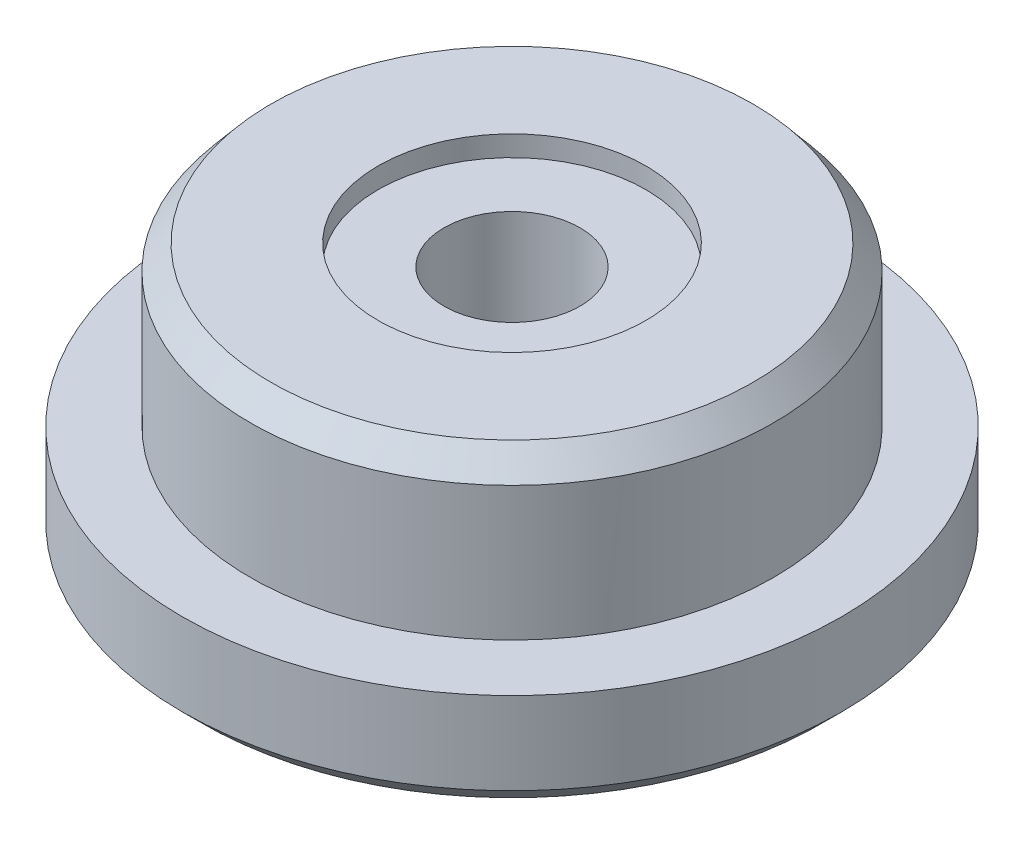
ISO-10303-21;
HEADER;
FILE_DESCRIPTION(('STEP AP214'),'2;1');
FILE_NAME('part.step','',(''),(''),'','','');
FILE_SCHEMA(('AUTOMOTIVE_DESIGN { 1 0 10303 214 1 1 1 1 }'));
ENDSEC;
DATA;
#1=APPLICATION_CONTEXT('core data for automotive mechanical design processes');
#2=APPLICATION_PROTOCOL_DEFINITION('international standard','automotive_design',2000,#1);
#3=PRODUCT_CONTEXT('',#1,'mechanical');
#4=PRODUCT('Part','Part','',(#3));
#5=PRODUCT_RELATED_PRODUCT_CATEGORY('part','',(#4));
#6=PRODUCT_DEFINITION_FORMATION('','',#4);
#7=PRODUCT_DEFINITION_CONTEXT('part definition',#1,'design');
#8=PRODUCT_DEFINITION('design','',#6,#7);
#9=PRODUCT_DEFINITION_SHAPE('','',#8);
#10=(LENGTH_UNIT() NAMED_UNIT(*) SI_UNIT(.MILLI.,.METRE.));
#11=(NAMED_UNIT(*) PLANE_ANGLE_UNIT() SI_UNIT($,.RADIAN.));
#12=(NAMED_UNIT(*) SI_UNIT($,.STERADIAN.) SOLID_ANGLE_UNIT());
#13=UNCERTAINTY_MEASURE_WITH_UNIT(LENGTH_MEASURE(1.E-05),#10,'distance_accuracy_value','');
#14=(GEOMETRIC_REPRESENTATION_CONTEXT(3) GLOBAL_UNCERTAINTY_ASSIGNED_CONTEXT((#13)) GLOBAL_UNIT_ASSIGNED_CONTEXT((#10,
#11,#12)) REPRESENTATION_CONTEXT('',''));
#15=CARTESIAN_POINT('',(0.,0.,0.));
#16=DIRECTION('',(0.,0.,1.));
#17=DIRECTION('',(1.,0.,0.));
#18=AXIS2_PLACEMENT_3D('',#15,#16,#17);
#19=CARTESIAN_POINT('',(-14.1950046636745,-3.57515728043431,0.));
#20=DIRECTION('',(0.,1.,0.));
#21=DIRECTION('',(-1.,0.,0.));
#22=AXIS2_PLACEMENT_3D('',#19,#20,#21);
#23=CYLINDRICAL_SURFACE('',#22,5.25);
#24=CARTESIAN_POINT('',(-14.1950046636745,-2.57515728043417,0.));
#25=DIRECTION('',(0.,1.,0.));
#26=DIRECTION('',(-1.,0.,0.));
#27=AXIS2_PLACEMENT_3D('',#24,#25,#26);
#28=CIRCLE('',#27,5.25);
#29=CARTESIAN_POINT('',(-19.4450046636745,-2.57515728043417,0.));
#30=VERTEX_POINT('',#29);
#31=EDGE_CURVE('E17',#30,#30,#28,.T.);
#32=ORIENTED_EDGE('',*,*,#31,.F.);
#33=EDGE_LOOP('',(#32));
#34=FACE_BOUND('',#33,.T.);
#35=CARTESIAN_POINT('',(-14.1950046636745,3.42484271956579,0.));
#36=DIRECTION('',(0.,1.,0.));
#37=DIRECTION('',(-1.,0.,0.));
#38=AXIS2_PLACEMENT_3D('',#35,#36,#37);
#39=CIRCLE('',#38,5.25);
#40=CARTESIAN_POINT('',(-19.4450046636745,3.42484271956579,0.));
#41=VERTEX_POINT('',#40);
#42=EDGE_CURVE('E61',#41,#41,#39,.F.);
#43=ORIENTED_EDGE('',*,*,#42,.F.);
#44=EDGE_LOOP('',(#43));
#45=FACE_BOUND('',#44,.T.);
#46=ADVANCED_FACE('F14',(#34,#45),#23,.F.);
#47=CARTESIAN_POINT('',(-5.6950046636745,-2.5751572804342,0.));
#48=DIRECTION('',(0.,-1.,0.));
#49=DIRECTION('',(1.,0.,0.));
#50=AXIS2_PLACEMENT_3D('',#47,#48,#49);
#51=PLANE('',#50);
#52=CARTESIAN_POINT('',(-14.1950046636745,-2.57515728043423,0.));
#53=DIRECTION('',(0.,1.,0.));
#54=DIRECTION('',(-1.,0.,0.));
#55=AXIS2_PLACEMENT_3D('',#52,#53,#54);
#56=CIRCLE('',#55,9.50000000000008);
#57=CARTESIAN_POINT('',(-23.6950046636745,-2.57515728043423,0.));
#58=VERTEX_POINT('',#57);
#59=EDGE_CURVE('E59',#58,#58,#56,.F.);
#60=ORIENTED_EDGE('',*,*,#59,.T.);
#61=EDGE_LOOP('',(#60));
#62=FACE_BOUND('',#61,.T.);
#63=ORIENTED_EDGE('',*,*,#31,.T.);
#64=EDGE_LOOP('',(#63));
#65=FACE_BOUND('',#64,.T.);
#66=ADVANCED_FACE('F68',(#62,#65),#51,.T.);
#67=CARTESIAN_POINT('',(-8.94500466367446,3.42484271956579,0.));
#68=DIRECTION('',(0.,-1.,0.));
#69=DIRECTION('',(1.,0.,0.));
#70=AXIS2_PLACEMENT_3D('',#67,#68,#69);
#71=PLANE('',#70);
#72=ORIENTED_EDGE('',*,*,#42,.T.);
#73=EDGE_LOOP('',(#72));
#74=FACE_BOUND('',#73,.T.);
#75=CARTESIAN_POINT('',(-14.1950046636745,3.42484271956579,0.));
#76=DIRECTION('',(0.,1.,0.));
#77=DIRECTION('',(-1.,0.,0.));
#78=AXIS2_PLACEMENT_3D('',#75,#76,#77);
#79=CIRCLE('',#78,3.3);
#80=CARTESIAN_POINT('',(-17.4950046636745,3.42484271956579,0.));
#81=VERTEX_POINT('',#80);
#82=EDGE_CURVE('E56',#81,#81,#79,.T.);
#83=ORIENTED_EDGE('',*,*,#82,.T.);
#84=EDGE_LOOP('',(#83));
#85=FACE_BOUND('',#84,.T.);
#86=ADVANCED_FACE('F75',(#74,#85),#71,.T.);
#87=CARTESIAN_POINT('',(-14.1950046636745,-3.57515728043431,0.));
#88=DIRECTION('',(0.,1.,0.));
#89=DIRECTION('',(-1.,0.,0.));
#90=AXIS2_PLACEMENT_3D('',#87,#88,#89);
#91=CYLINDRICAL_SURFACE('',#90,9.50000000000008);
#92=CARTESIAN_POINT('',(-14.1950046636745,-3.57515728043431,0.));
#93=DIRECTION('',(0.,1.,0.));
#94=DIRECTION('',(-1.,0.,0.));
#95=AXIS2_PLACEMENT_3D('',#92,#93,#94);
#96=CIRCLE('',#95,9.50000000000008);
#97=CARTESIAN_POINT('',(-23.6950046636745,-3.57515728043431,0.));
#98=VERTEX_POINT('',#97);
#99=EDGE_CURVE('E53',#98,#98,#96,.T.);
#100=ORIENTED_EDGE('',*,*,#99,.F.);
#101=EDGE_LOOP('',(#100));
#102=FACE_BOUND('',#101,.T.);
#103=ORIENTED_EDGE('',*,*,#59,.F.);
#104=EDGE_LOOP('',(#103));
#105=FACE_BOUND('',#104,.T.);
#106=ADVANCED_FACE('F119',(#102,#105),#91,.F.);
#107=CARTESIAN_POINT('',(-14.1950046636745,-3.57515728043431,0.));
#108=DIRECTION('',(0.,1.,0.));
#109=DIRECTION('',(-1.,0.,0.));
#110=AXIS2_PLACEMENT_3D('',#107,#108,#109);
#111=CYLINDRICAL_SURFACE('',#110,3.3);
#112=ORIENTED_EDGE('',*,*,#82,.F.);
#113=EDGE_LOOP('',(#112));
#114=FACE_BOUND('',#113,.T.);
#115=CARTESIAN_POINT('',(-14.1950046636745,8.1248427195657,0.));
#116=DIRECTION('',(0.,1.,0.));
#117=DIRECTION('',(-1.,0.,0.));
#118=AXIS2_PLACEMENT_3D('',#115,#116,#117);
#119=CIRCLE('',#118,3.3);
#120=CARTESIAN_POINT('',(-17.4950046636745,8.1248427195657,0.));
#121=VERTEX_POINT('',#120);
#122=EDGE_CURVE('E50',#121,#121,#119,.F.);
#123=ORIENTED_EDGE('',*,*,#122,.F.);
#124=EDGE_LOOP('',(#123));
#125=FACE_BOUND('',#124,.T.);
#126=ADVANCED_FACE('F115',(#114,#125),#111,.F.);
#127=CARTESIAN_POINT('',(0.804995336325573,-3.57515728043427,0.));
#128=DIRECTION('',(0.,-1.,0.));
#129=DIRECTION('',(1.,0.,0.));
#130=AXIS2_PLACEMENT_3D('',#127,#128,#129);
#131=PLANE('',#130);
#132=ORIENTED_EDGE('',*,*,#99,.T.);
#133=EDGE_LOOP('',(#132));
#134=FACE_BOUND('',#133,.T.);
#135=CARTESIAN_POINT('',(-14.1950046636745,-3.57515728043423,0.));
#136=DIRECTION('',(0.,1.,0.));
#137=DIRECTION('',(-1.,0.,0.));
#138=AXIS2_PLACEMENT_3D('',#135,#136,#137);
#139=CIRCLE('',#138,15.);
#140=CARTESIAN_POINT('',(-29.1950046636745,-3.57515728043423,0.));
#141=VERTEX_POINT('',#140);
#142=EDGE_CURVE('E47',#141,#141,#139,.T.);
#143=ORIENTED_EDGE('',*,*,#142,.F.);
#144=EDGE_LOOP('',(#143));
#145=FACE_BOUND('',#144,.T.);
#146=ADVANCED_FACE('F111',(#134,#145),#131,.T.);
#147=CARTESIAN_POINT('',(-7.69500466367446,8.1248427195657,0.));
#148=DIRECTION('',(0.,1.,0.));
#149=DIRECTION('',(-1.,0.,0.));
#150=AXIS2_PLACEMENT_3D('',#147,#148,#149);
#151=PLANE('',#150);
#152=ORIENTED_EDGE('',*,*,#122,.T.);
#153=EDGE_LOOP('',(#152));
#154=FACE_BOUND('',#153,.T.);
#155=CARTESIAN_POINT('',(-14.1950046636745,8.1248427195657,0.));
#156=DIRECTION('',(0.,1.,0.));
#157=DIRECTION('',(-1.,0.,0.));
#158=AXIS2_PLACEMENT_3D('',#155,#156,#157);
#159=CIRCLE('',#158,6.5);
#160=CARTESIAN_POINT('',(-20.6950046636745,8.1248427195657,0.));
#161=VERTEX_POINT('',#160);
#162=EDGE_CURVE('E35',#161,#161,#159,.T.);
#163=ORIENTED_EDGE('',*,*,#162,.T.);
#164=EDGE_LOOP('',(#163));
#165=FACE_BOUND('',#164,.T.);
#166=ADVANCED_FACE('F107',(#154,#165),#151,.T.);
#167=CARTESIAN_POINT('',(-14.1950046636745,-2.57515728043423,0.));
#168=DIRECTION('',(0.,1.,0.));
#169=DIRECTION('',(-1.,0.,0.));
#170=AXIS2_PLACEMENT_3D('',#167,#168,#169);
#171=CONICAL_SURFACE('',#170,16.,0.785398163397431);
#172=CARTESIAN_POINT('',(-14.1950046636745,-2.57515728043423,0.));
#173=DIRECTION('',(0.,1.,0.));
#174=DIRECTION('',(-1.,0.,0.));
#175=AXIS2_PLACEMENT_3D('',#172,#173,#174);
#176=CIRCLE('',#175,16.);
#177=CARTESIAN_POINT('',(-30.1950046636745,-2.57515728043423,0.));
#178=VERTEX_POINT('',#177);
#179=EDGE_CURVE('E31',#178,#178,#176,.T.);
#180=ORIENTED_EDGE('',*,*,#179,.F.);
#181=EDGE_LOOP('',(#180));
#182=FACE_BOUND('',#181,.T.);
#183=ORIENTED_EDGE('',*,*,#142,.T.);
#184=EDGE_LOOP('',(#183));
#185=FACE_BOUND('',#184,.T.);
#186=ADVANCED_FACE('F103',(#182,#185),#171,.T.);
#187=CARTESIAN_POINT('',(-14.1950046636745,-3.57515728043431,0.));
#188=DIRECTION('',(0.,1.,0.));
#189=DIRECTION('',(-1.,0.,0.));
#190=AXIS2_PLACEMENT_3D('',#187,#188,#189);
#191=CYLINDRICAL_SURFACE('',#190,6.5);
#192=ORIENTED_EDGE('',*,*,#162,.F.);
#193=EDGE_LOOP('',(#192));
#194=FACE_BOUND('',#193,.T.);
#195=CARTESIAN_POINT('',(-14.1950046636745,9.12484271956579,0.));
#196=DIRECTION('',(0.,1.,0.));
#197=DIRECTION('',(-1.,0.,0.));
#198=AXIS2_PLACEMENT_3D('',#195,#196,#197);
#199=CIRCLE('',#198,6.5);
#200=CARTESIAN_POINT('',(-20.6950046636745,9.12484271956579,0.));
#201=VERTEX_POINT('',#200);
#202=EDGE_CURVE('E34',#201,#201,#199,.F.);
#203=ORIENTED_EDGE('',*,*,#202,.F.);
#204=EDGE_LOOP('',(#203));
#205=FACE_BOUND('',#204,.T.);
#206=ADVANCED_FACE('F99',(#194,#205),#191,.F.);
#207=CARTESIAN_POINT('',(-14.1950046636745,-3.57515728043431,0.));
#208=DIRECTION('',(0.,1.,0.));
#209=DIRECTION('',(-1.,0.,0.));
#210=AXIS2_PLACEMENT_3D('',#207,#208,#209);
#211=CYLINDRICAL_SURFACE('',#210,16.);
#212=CARTESIAN_POINT('',(-14.1950046636745,1.42484271956579,0.));
#213=DIRECTION('',(0.,1.,0.));
#214=DIRECTION('',(-1.,0.,0.));
#215=AXIS2_PLACEMENT_3D('',#212,#213,#214);
#216=CIRCLE('',#215,16.);
#217=CARTESIAN_POINT('',(-30.1950046636745,1.42484271956579,0.));
#218=VERTEX_POINT('',#217);
#219=EDGE_CURVE('E40',#218,#218,#216,.T.);
#220=ORIENTED_EDGE('',*,*,#219,.F.);
#221=EDGE_LOOP('',(#220));
#222=FACE_BOUND('',#221,.T.);
#223=ORIENTED_EDGE('',*,*,#179,.T.);
#224=EDGE_LOOP('',(#223));
#225=FACE_BOUND('',#224,.T.);
#226=ADVANCED_FACE('F95',(#222,#225),#211,.T.);
#227=CARTESIAN_POINT('',(-7.69500466367446,9.12484271956579,0.));
#228=DIRECTION('',(0.,1.,0.));
#229=DIRECTION('',(-1.,0.,0.));
#230=AXIS2_PLACEMENT_3D('',#227,#228,#229);
#231=PLANE('',#230);
#232=ORIENTED_EDGE('',*,*,#202,.T.);
#233=EDGE_LOOP('',(#232));
#234=FACE_BOUND('',#233,.T.);
#235=CARTESIAN_POINT('',(-14.1950046636745,9.12484271956579,0.));
#236=DIRECTION('',(0.,-1.,0.));
#237=DIRECTION('',(0.,0.,-1.));
#238=AXIS2_PLACEMENT_3D('',#235,#236,#237);
#239=CIRCLE('',#238,11.7000000000001);
#240=CARTESIAN_POINT('',(-14.1950046636745,9.12484271956579,-11.7000000000001));
#241=VERTEX_POINT('',#240);
#242=EDGE_CURVE('E26',#241,#241,#239,.T.);
#243=ORIENTED_EDGE('',*,*,#242,.F.);
#244=EDGE_LOOP('',(#243));
#245=FACE_BOUND('',#244,.T.);
#246=ADVANCED_FACE('F91',(#234,#245),#231,.T.);
#247=CARTESIAN_POINT('',(-1.49500466367446,1.42484271956579,0.));
#248=DIRECTION('',(0.,1.,0.));
#249=DIRECTION('',(-1.,0.,0.));
#250=AXIS2_PLACEMENT_3D('',#247,#248,#249);
#251=PLANE('',#250);
#252=CARTESIAN_POINT('',(-14.1950046636745,1.42484271956579,0.));
#253=DIRECTION('',(0.,1.,0.));
#254=DIRECTION('',(-1.,0.,0.));
#255=AXIS2_PLACEMENT_3D('',#252,#253,#254);
#256=CIRCLE('',#255,12.7);
#257=CARTESIAN_POINT('',(-26.8950046636745,1.42484271956579,0.));
#258=VERTEX_POINT('',#257);
#259=EDGE_CURVE('E21',#258,#258,#256,.T.);
#260=ORIENTED_EDGE('',*,*,#259,.F.);
#261=EDGE_LOOP('',(#260));
#262=FACE_BOUND('',#261,.T.);
#263=ORIENTED_EDGE('',*,*,#219,.T.);
#264=EDGE_LOOP('',(#263));
#265=FACE_BOUND('',#264,.T.);
#266=ADVANCED_FACE('F84',(#262,#265),#251,.T.);
#267=CARTESIAN_POINT('',(-14.1950046636745,7.92484271956584,0.));
#268=DIRECTION('',(0.,-1.,0.));
#269=DIRECTION('',(0.,0.,-1.));
#270=AXIS2_PLACEMENT_3D('',#267,#268,#269);
#271=CONICAL_SURFACE('',#270,12.7,0.6947382761967);
#272=ORIENTED_EDGE('',*,*,#242,.T.);
#273=EDGE_LOOP('',(#272));
#274=FACE_BOUND('',#273,.T.);
#275=CARTESIAN_POINT('',(-14.1950046636745,7.92484271956584,0.));
#276=DIRECTION('',(0.,1.,0.));
#277=DIRECTION('',(-1.,0.,0.));
#278=AXIS2_PLACEMENT_3D('',#275,#276,#277);
#279=CIRCLE('',#278,12.7);
#280=CARTESIAN_POINT('',(-26.8950046636745,7.92484271956584,0.));
#281=VERTEX_POINT('',#280);
#282=EDGE_CURVE('E8',#281,#281,#279,.F.);
#283=ORIENTED_EDGE('',*,*,#282,.F.);
#284=EDGE_LOOP('',(#283));
#285=FACE_BOUND('',#284,.T.);
#286=ADVANCED_FACE('F79',(#274,#285),#271,.T.);
#287=CARTESIAN_POINT('',(-14.1950046636745,-3.57515728043431,0.));
#288=DIRECTION('',(0.,1.,0.));
#289=DIRECTION('',(-1.,0.,0.));
#290=AXIS2_PLACEMENT_3D('',#287,#288,#289);
#291=CYLINDRICAL_SURFACE('',#290,12.7);
#292=ORIENTED_EDGE('',*,*,#282,.T.);
#293=EDGE_LOOP('',(#292));
#294=FACE_BOUND('',#293,.T.);
#295=ORIENTED_EDGE('',*,*,#259,.T.);
#296=EDGE_LOOP('',(#295));
#297=FACE_BOUND('',#296,.T.);
#298=ADVANCED_FACE('F77',(#294,#297),#291,.T.);
#299=CLOSED_SHELL('',(#46,#66,#86,#106,#126,#146,#166,#186,#206,#226,#246,#266,#286,#298));
#300=MANIFOLD_SOLID_BREP('B1',#299);
#301=ADVANCED_BREP_SHAPE_REPRESENTATION('',(#18,#300),#14);
#302=SHAPE_DEFINITION_REPRESENTATION(#9,#301);
ENDSEC;
END-ISO-10303-21;
